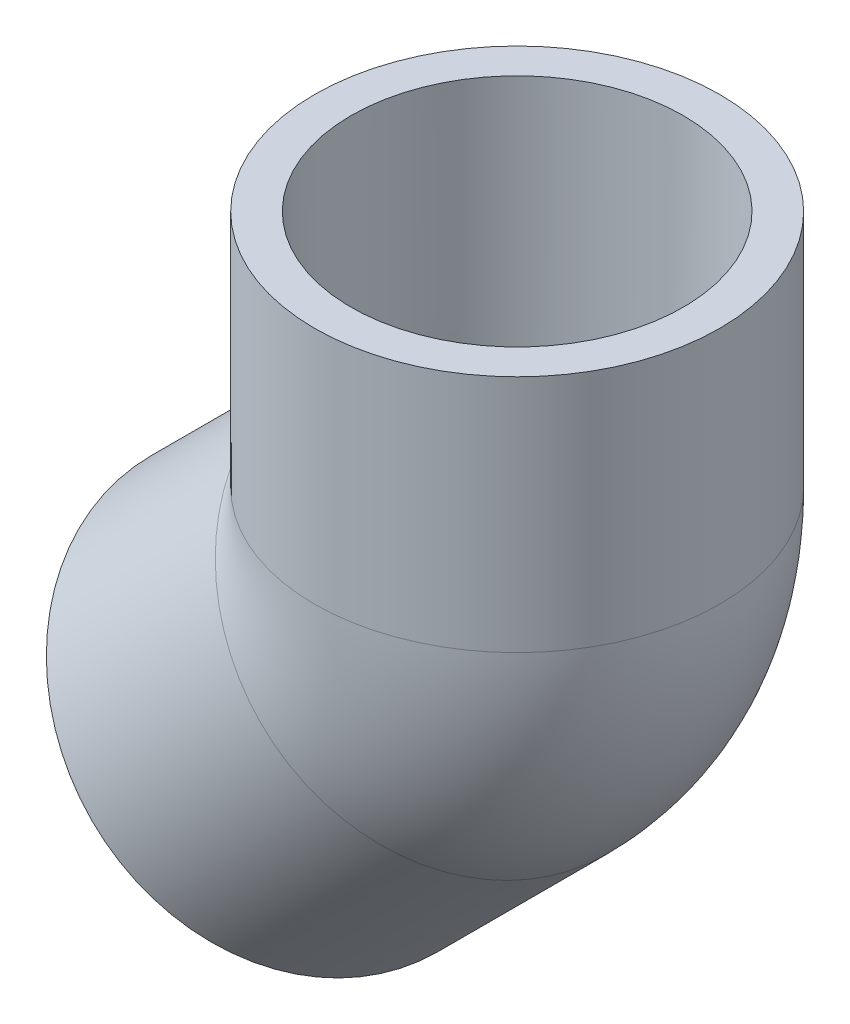
ISO-10303-21;
HEADER;
FILE_DESCRIPTION(('STEP AP214'),'2;1');
FILE_NAME('part.step','',(''),(''),'','','');
FILE_SCHEMA(('AUTOMOTIVE_DESIGN { 1 0 10303 214 1 1 1 1 }'));
ENDSEC;
DATA;
#1=APPLICATION_CONTEXT('core data for automotive mechanical design processes');
#2=APPLICATION_PROTOCOL_DEFINITION('international standard','automotive_design',2000,#1);
#3=PRODUCT_CONTEXT('',#1,'mechanical');
#4=PRODUCT('Part','Part','',(#3));
#5=PRODUCT_RELATED_PRODUCT_CATEGORY('part','',(#4));
#6=PRODUCT_DEFINITION_FORMATION('','',#4);
#7=PRODUCT_DEFINITION_CONTEXT('part definition',#1,'design');
#8=PRODUCT_DEFINITION('design','',#6,#7);
#9=PRODUCT_DEFINITION_SHAPE('','',#8);
#10=(LENGTH_UNIT() NAMED_UNIT(*) SI_UNIT(.MILLI.,.METRE.));
#11=(NAMED_UNIT(*) PLANE_ANGLE_UNIT() SI_UNIT($,.RADIAN.));
#12=(NAMED_UNIT(*) SI_UNIT($,.STERADIAN.) SOLID_ANGLE_UNIT());
#13=UNCERTAINTY_MEASURE_WITH_UNIT(LENGTH_MEASURE(1.E-05),#10,'distance_accuracy_value','');
#14=(GEOMETRIC_REPRESENTATION_CONTEXT(3) GLOBAL_UNCERTAINTY_ASSIGNED_CONTEXT((#13)) GLOBAL_UNIT_ASSIGNED_CONTEXT((#10,
#11,#12)) REPRESENTATION_CONTEXT('',''));
#15=CARTESIAN_POINT('',(0.,0.,0.));
#16=DIRECTION('',(0.,0.,1.));
#17=DIRECTION('',(1.,0.,0.));
#18=AXIS2_PLACEMENT_3D('',#15,#16,#17);
#19=CARTESIAN_POINT('',(-11.6204514206636,-53.50436596933,0.));
#20=DIRECTION('',(-0.707106781186549,-0.707106781186546,0.));
#21=DIRECTION('',(0.707106781186546,-0.707106781186549,0.));
#22=AXIS2_PLACEMENT_3D('',#19,#20,#21);
#23=PLANE('',#22);
#24=CARTESIAN_POINT('',(-32.5624086949968,-32.5624086949967,0.));
#25=DIRECTION('',(-0.707106781186549,-0.707106781186546,0.));
#26=DIRECTION('',(0.707106781186546,-0.707106781186549,0.));
#27=AXIS2_PLACEMENT_3D('',#24,#25,#26);
#28=CIRCLE('',#27,29.6164);
#29=CARTESIAN_POINT('',(-11.6204514206636,-53.50436596933,0.));
#30=VERTEX_POINT('',#29);
#31=EDGE_CURVE('E59',#30,#30,#28,.T.);
#32=ORIENTED_EDGE('',*,*,#31,.T.);
#33=EDGE_LOOP('',(#32));
#34=FACE_BOUND('',#33,.T.);
#35=CARTESIAN_POINT('',(-32.5624086949968,-32.5624086949967,0.));
#36=DIRECTION('',(-0.707106781186549,-0.707106781186546,0.));
#37=DIRECTION('',(0.707106781186546,-0.707106781186549,0.));
#38=AXIS2_PLACEMENT_3D('',#35,#36,#37);
#39=CIRCLE('',#38,24.2824);
#40=CARTESIAN_POINT('',(-15.3921589915126,-49.7326583984809,0.));
#41=VERTEX_POINT('',#40);
#42=EDGE_CURVE('E39',#41,#41,#39,.T.);
#43=ORIENTED_EDGE('',*,*,#42,.F.);
#44=EDGE_LOOP('',(#43));
#45=FACE_BOUND('',#44,.T.);
#46=ADVANCED_FACE('F32',(#34,#45),#23,.T.);
#47=CARTESIAN_POINT('',(-7.86670436205659,-7.86670436205656,0.));
#48=DIRECTION('',(-0.707106781186549,-0.707106781186546,0.));
#49=DIRECTION('',(0.707106781186546,-0.707106781186549,0.));
#50=AXIS2_PLACEMENT_3D('',#47,#48,#49);
#51=CONICAL_SURFACE('',#50,24.0538,0.00654536107227543);
#52=ORIENTED_EDGE('',*,*,#42,.T.);
#53=EDGE_LOOP('',(#52));
#54=FACE_BOUND('',#53,.T.);
#55=CARTESIAN_POINT('',(-7.86670436205659,-7.86670436205656,0.));
#56=DIRECTION('',(-0.707106781186549,-0.707106781186546,0.));
#57=DIRECTION('',(0.707106781186546,-0.707106781186549,0.));
#58=AXIS2_PLACEMENT_3D('',#55,#56,#57);
#59=CIRCLE('',#58,24.0538);
#60=CARTESIAN_POINT('',(9.14190073124833,-24.8753094553616,0.));
#61=VERTEX_POINT('',#60);
#62=EDGE_CURVE('E77',#61,#61,#59,.T.);
#63=ORIENTED_EDGE('',*,*,#62,.F.);
#64=EDGE_LOOP('',(#63));
#65=FACE_BOUND('',#64,.T.);
#66=ADVANCED_FACE('F86',(#54,#65),#51,.F.);
#67=CARTESIAN_POINT('',(-32.5624086949968,-32.5624086949967,0.));
#68=DIRECTION('',(-0.707106781186549,-0.707106781186546,0.));
#69=DIRECTION('',(0.707106781186546,-0.707106781186549,0.));
#70=AXIS2_PLACEMENT_3D('',#67,#68,#69);
#71=CYLINDRICAL_SURFACE('',#70,29.6164);
#72=CARTESIAN_POINT('',(0.,0.,0.));
#73=DIRECTION('',(-0.382683432365091,-0.923879532511286,0.));
#74=DIRECTION('',(-0.923879532511286,0.382683432365091,0.));
#75=AXIS2_PLACEMENT_3D('',#72,#73,#74);
#76=ELLIPSE('',#75,32.0565603607396,29.6164);
#77=CARTESIAN_POINT('',(-26.8586087241131,11.1252,-12.4798351898169));
#78=VERTEX_POINT('',#77);
#79=CARTESIAN_POINT('',(-26.8586087241131,11.1252,12.479835189817));
#80=VERTEX_POINT('',#79);
#81=EDGE_CURVE('E53',#78,#80,#76,.F.);
#82=ORIENTED_EDGE('',*,*,#81,.F.);
#83=CARTESIAN_POINT('',(-7.86670436205659,-7.86670436205656,0.));
#84=DIRECTION('',(0.707106781186549,0.707106781186546,0.));
#85=DIRECTION('',(-0.707106781186546,0.707106781186549,0.));
#86=AXIS2_PLACEMENT_3D('',#83,#84,#85);
#87=CIRCLE('',#86,29.6164);
#88=EDGE_CURVE('E50',#80,#78,#87,.T.);
#89=ORIENTED_EDGE('',*,*,#88,.F.);
#90=EDGE_LOOP('',(#82,#89));
#91=FACE_BOUND('',#90,.T.);
#92=ORIENTED_EDGE('',*,*,#31,.F.);
#93=EDGE_LOOP('',(#92));
#94=FACE_BOUND('',#93,.T.);
#95=ADVANCED_FACE('F51',(#91,#94),#71,.T.);
#96=CARTESIAN_POINT('',(-7.86670436205659,-7.86670436205656,0.));
#97=DIRECTION('',(0.707106781186549,0.707106781186546,0.));
#98=DIRECTION('',(-0.707106781186546,0.707106781186549,0.));
#99=AXIS2_PLACEMENT_3D('',#96,#97,#98);
#100=PLANE('',#99);
#101=CARTESIAN_POINT('',(-7.86670436205659,-7.86670436205656,0.));
#102=DIRECTION('',(0.707106781186549,0.707106781186546,0.));
#103=DIRECTION('',(-0.707106781186546,0.707106781186549,0.));
#104=AXIS2_PLACEMENT_3D('',#101,#102,#103);
#105=CIRCLE('',#104,19.05);
#106=CARTESIAN_POINT('',(5.60367981954712,-21.3370885436603,0.));
#107=VERTEX_POINT('',#106);
#108=EDGE_CURVE('E56',#107,#107,#105,.T.);
#109=ORIENTED_EDGE('',*,*,#108,.T.);
#110=EDGE_LOOP('',(#109));
#111=FACE_BOUND('',#110,.T.);
#112=ORIENTED_EDGE('',*,*,#62,.T.);
#113=EDGE_LOOP('',(#112));
#114=FACE_BOUND('',#113,.T.);
#115=ADVANCED_FACE('F96',(#111,#114),#100,.F.);
#116=CARTESIAN_POINT('',(-53.7172174482262,11.1252,0.));
#117=DIRECTION('',(0.,-1.,0.));
#118=DIRECTION('',(-1.,0.,0.));
#119=AXIS2_PLACEMENT_3D('',#116,#117,#118);
#120=CIRCLE('',#119,29.6164);
#121=TRIMMED_CURVE('',#120,(PARAMETER_VALUE(-2.70662332632856)),
(PARAMETER_VALUE(2.70662332632856)),.T.,.PARAMETER.);
#122=CARTESIAN_POINT('',(-26.8586087241131,11.1252,0.));
#123=DIRECTION('',(0.,0.,-1.));
#124=AXIS1_PLACEMENT('',#122,#123);
#125=SURFACE_OF_REVOLUTION('',#121,#124);
#126=ORIENTED_EDGE('',*,*,#88,.T.);
#127=CARTESIAN_POINT('',(0.,11.1252,0.));
#128=DIRECTION('',(0.,1.,0.));
#129=DIRECTION('',(-1.,0.,0.));
#130=AXIS2_PLACEMENT_3D('',#127,#128,#129);
#131=CIRCLE('',#130,29.6164);
#132=EDGE_CURVE('E45',#80,#78,#131,.T.);
#133=ORIENTED_EDGE('',*,*,#132,.F.);
#134=EDGE_LOOP('',(#126,#133));
#135=FACE_BOUND('',#134,.T.);
#136=ADVANCED_FACE('F58',(#135),#125,.T.);
#137=CARTESIAN_POINT('',(-26.8586087241131,11.1252,0.));
#138=DIRECTION('',(0.,0.,-1.));
#139=DIRECTION('',(-1.,0.,0.));
#140=AXIS2_PLACEMENT_3D('',#137,#138,#139);
#141=TOROIDAL_SURFACE('',#140,26.8586087241131,19.05);
#142=CARTESIAN_POINT('',(0.,11.1252,0.));
#143=DIRECTION('',(0.,1.,0.));
#144=DIRECTION('',(-1.,0.,0.));
#145=AXIS2_PLACEMENT_3D('',#142,#143,#144);
#146=CIRCLE('',#145,19.05);
#147=CARTESIAN_POINT('',(19.05,11.1252000000001,0.));
#148=VERTEX_POINT('',#147);
#149=EDGE_CURVE('E55',#148,#148,#146,.T.);
#150=CARTESIAN_POINT('',(-26.8586087241131,11.1252,0.));
#151=DIRECTION('',(0.,0.,-1.));
#152=DIRECTION('',(-1.,0.,0.));
#153=AXIS2_PLACEMENT_3D('',#150,#151,#152);
#154=CIRCLE('',#153,45.9086087241131);
#155=EDGE_CURVE('',#148,#107,#154,.T.);
#156=ORIENTED_EDGE('',*,*,#149,.T.);
#157=ORIENTED_EDGE('',*,*,#108,.F.);
#158=ORIENTED_EDGE('',*,*,#155,.T.);
#159=ORIENTED_EDGE('',*,*,#155,.F.);
#160=EDGE_LOOP('',(#156,#158,#157,#159));
#161=FACE_BOUND('',#160,.T.);
#162=ADVANCED_FACE('F106',(#161),#141,.F.);
#163=CARTESIAN_POINT('',(0.,11.1252,0.));
#164=DIRECTION('',(0.,1.,0.));
#165=DIRECTION('',(-1.,0.,0.));
#166=AXIS2_PLACEMENT_3D('',#163,#164,#165);
#167=PLANE('',#166);
#168=CARTESIAN_POINT('',(0.,11.1252000000001,0.));
#169=DIRECTION('',(0.,1.,0.));
#170=DIRECTION('',(-1.,0.,0.));
#171=AXIS2_PLACEMENT_3D('',#168,#169,#170);
#172=CIRCLE('',#171,24.0538);
#173=CARTESIAN_POINT('',(-24.0538,11.1252,0.));
#174=VERTEX_POINT('',#173);
#175=EDGE_CURVE('E11',#174,#174,#172,.F.);
#176=ORIENTED_EDGE('',*,*,#175,.F.);
#177=EDGE_LOOP('',(#176));
#178=FACE_BOUND('',#177,.T.);
#179=ORIENTED_EDGE('',*,*,#149,.F.);
#180=EDGE_LOOP('',(#179));
#181=FACE_BOUND('',#180,.T.);
#182=ADVANCED_FACE('F109',(#178,#181),#167,.T.);
#183=CARTESIAN_POINT('',(29.6164,46.0502,0.));
#184=DIRECTION('',(0.,1.,0.));
#185=DIRECTION('',(0.,0.,1.));
#186=AXIS2_PLACEMENT_3D('',#183,#184,#185);
#187=PLANE('',#186);
#188=CARTESIAN_POINT('',(0.,46.0502,0.));
#189=DIRECTION('',(0.,-1.,0.));
#190=DIRECTION('',(0.,0.,-1.));
#191=AXIS2_PLACEMENT_3D('',#188,#189,#190);
#192=CIRCLE('',#191,24.2824);
#193=CARTESIAN_POINT('',(0.,46.0502,-24.2824));
#194=VERTEX_POINT('',#193);
#195=EDGE_CURVE('E67',#194,#194,#192,.T.);
#196=ORIENTED_EDGE('',*,*,#195,.T.);
#197=EDGE_LOOP('',(#196));
#198=FACE_BOUND('',#197,.T.);
#199=CARTESIAN_POINT('',(0.,46.0502,0.));
#200=DIRECTION('',(0.,-1.,0.));
#201=DIRECTION('',(0.,0.,-1.));
#202=AXIS2_PLACEMENT_3D('',#199,#200,#201);
#203=CIRCLE('',#202,29.6164);
#204=CARTESIAN_POINT('',(0.,46.0502,-29.6164));
#205=VERTEX_POINT('',#204);
#206=EDGE_CURVE('E62',#205,#205,#203,.T.);
#207=ORIENTED_EDGE('',*,*,#206,.F.);
#208=EDGE_LOOP('',(#207));
#209=FACE_BOUND('',#208,.T.);
#210=ADVANCED_FACE('F112',(#198,#209),#187,.T.);
#211=CARTESIAN_POINT('',(0.,0.,0.));
#212=DIRECTION('',(0.,-1.,0.));
#213=DIRECTION('',(0.,0.,-1.));
#214=AXIS2_PLACEMENT_3D('',#211,#212,#213);
#215=CYLINDRICAL_SURFACE('',#214,29.6164);
#216=ORIENTED_EDGE('',*,*,#206,.T.);
#217=EDGE_LOOP('',(#216));
#218=FACE_BOUND('',#217,.T.);
#219=ORIENTED_EDGE('',*,*,#132,.T.);
#220=ORIENTED_EDGE('',*,*,#81,.T.);
#221=EDGE_LOOP('',(#219,#220));
#222=FACE_BOUND('',#221,.T.);
#223=ADVANCED_FACE('F61',(#218,#222),#215,.T.);
#224=CARTESIAN_POINT('',(0.,46.0502,0.));
#225=DIRECTION('',(0.,1.,0.));
#226=DIRECTION('',(0.,0.,1.));
#227=AXIS2_PLACEMENT_3D('',#224,#225,#226);
#228=CONICAL_SURFACE('',#227,24.2824,0.00654536107227523);
#229=ORIENTED_EDGE('',*,*,#175,.T.);
#230=EDGE_LOOP('',(#229));
#231=FACE_BOUND('',#230,.T.);
#232=ORIENTED_EDGE('',*,*,#195,.F.);
#233=EDGE_LOOP('',(#232));
#234=FACE_BOUND('',#233,.T.);
#235=ADVANCED_FACE('F120',(#231,#234),#228,.F.);
#236=CLOSED_SHELL('',(#46,#66,#95,#115,#136,#162,#182,#210,#223,#235));
#237=MANIFOLD_SOLID_BREP('B2',#236);
#238=ADVANCED_BREP_SHAPE_REPRESENTATION('',(#18,#237),#14);
#239=SHAPE_DEFINITION_REPRESENTATION(#9,#238);
ENDSEC;
END-ISO-10303-21;
